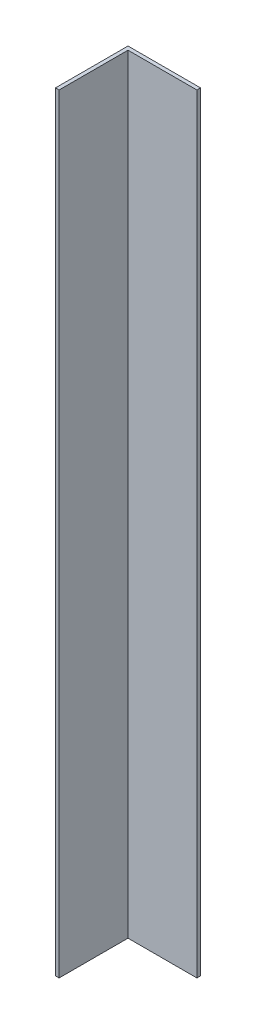
ISO-10303-21;
HEADER;
FILE_DESCRIPTION(('STEP AP214'),'2;1');
FILE_NAME('part.step','',(''),(''),'','','');
FILE_SCHEMA(('AUTOMOTIVE_DESIGN { 1 0 10303 214 1 1 1 1 }'));
ENDSEC;
DATA;
#1=APPLICATION_CONTEXT('core data for automotive mechanical design processes');
#2=APPLICATION_PROTOCOL_DEFINITION('international standard','automotive_design',2000,#1);
#3=PRODUCT_CONTEXT('',#1,'mechanical');
#4=PRODUCT('Part','Part','',(#3));
#5=PRODUCT_RELATED_PRODUCT_CATEGORY('part','',(#4));
#6=PRODUCT_DEFINITION_FORMATION('','',#4);
#7=PRODUCT_DEFINITION_CONTEXT('part definition',#1,'design');
#8=PRODUCT_DEFINITION('design','',#6,#7);
#9=PRODUCT_DEFINITION_SHAPE('','',#8);
#10=(LENGTH_UNIT() NAMED_UNIT(*) SI_UNIT(.MILLI.,.METRE.));
#11=(NAMED_UNIT(*) PLANE_ANGLE_UNIT() SI_UNIT($,.RADIAN.));
#12=(NAMED_UNIT(*) SI_UNIT($,.STERADIAN.) SOLID_ANGLE_UNIT());
#13=UNCERTAINTY_MEASURE_WITH_UNIT(LENGTH_MEASURE(1.E-05),#10,'distance_accuracy_value','');
#14=(GEOMETRIC_REPRESENTATION_CONTEXT(3) GLOBAL_UNCERTAINTY_ASSIGNED_CONTEXT((#13)) GLOBAL_UNIT_ASSIGNED_CONTEXT((#10,
#11,#12)) REPRESENTATION_CONTEXT('',''));
#15=CARTESIAN_POINT('',(0.,0.,0.));
#16=DIRECTION('',(0.,0.,1.));
#17=DIRECTION('',(1.,0.,0.));
#18=AXIS2_PLACEMENT_3D('',#15,#16,#17);
#19=CARTESIAN_POINT('',(-20.,424.,-20.1136363636364));
#20=DIRECTION('',(1.,0.,0.));
#21=DIRECTION('',(0.,0.,-1.));
#22=AXIS2_PLACEMENT_3D('',#19,#20,#21);
#23=PLANE('',#22);
#24=DIRECTION('',(0.,0.,1.));
#25=VECTOR('',#24,1.);
#26=CARTESIAN_POINT('',(-20.,0.,-20.1136363636364));
#27=LINE('',#26,#25);
#28=CARTESIAN_POINT('',(-20.,0.,-20.1136363636364));
#29=VERTEX_POINT('',#28);
#30=CARTESIAN_POINT('',(-20.,0.,19.8863636363636));
#31=VERTEX_POINT('',#30);
#32=EDGE_CURVE('E117',#29,#31,#27,.T.);
#33=ORIENTED_EDGE('',*,*,#32,.T.);
#34=DIRECTION('',(0.,-1.,0.));
#35=VECTOR('',#34,1.);
#36=CARTESIAN_POINT('',(-20.,424.,19.8863636363636));
#37=LINE('',#36,#35);
#38=CARTESIAN_POINT('',(-20.,424.,19.8863636363636));
#39=VERTEX_POINT('',#38);
#40=EDGE_CURVE('E11',#39,#31,#37,.T.);
#41=ORIENTED_EDGE('',*,*,#40,.F.);
#42=DIRECTION('',(0.,0.,1.));
#43=VECTOR('',#42,1.);
#44=CARTESIAN_POINT('',(-20.,424.,-20.1136363636364));
#45=LINE('',#44,#43);
#46=CARTESIAN_POINT('',(-20.,424.,-20.1136363636364));
#47=VERTEX_POINT('',#46);
#48=EDGE_CURVE('E127',#47,#39,#45,.T.);
#49=ORIENTED_EDGE('',*,*,#48,.F.);
#50=DIRECTION('',(0.,-1.,0.));
#51=VECTOR('',#50,1.);
#52=CARTESIAN_POINT('',(-20.,424.,-20.1136363636364));
#53=LINE('',#52,#51);
#54=EDGE_CURVE('E113',#47,#29,#53,.T.);
#55=ORIENTED_EDGE('',*,*,#54,.T.);
#56=EDGE_LOOP('',(#33,#41,#49,#55));
#57=FACE_BOUND('',#56,.T.);
#58=ADVANCED_FACE('F33',(#57),#23,.F.);
#59=CARTESIAN_POINT('',(-20.,424.,19.8863636363636));
#60=DIRECTION('',(0.,0.,-1.));
#61=DIRECTION('',(-1.,0.,0.));
#62=AXIS2_PLACEMENT_3D('',#59,#60,#61);
#63=PLANE('',#62);
#64=DIRECTION('',(1.,0.,0.));
#65=VECTOR('',#64,1.);
#66=CARTESIAN_POINT('',(-20.,0.,19.8863636363636));
#67=LINE('',#66,#65);
#68=CARTESIAN_POINT('',(-18.,0.,19.8863636363636));
#69=VERTEX_POINT('',#68);
#70=EDGE_CURVE('E120',#31,#69,#67,.T.);
#71=ORIENTED_EDGE('',*,*,#70,.T.);
#72=DIRECTION('',(0.,-1.,0.));
#73=VECTOR('',#72,1.);
#74=CARTESIAN_POINT('',(-18.,424.,19.8863636363636));
#75=LINE('',#74,#73);
#76=CARTESIAN_POINT('',(-18.,424.,19.8863636363636));
#77=VERTEX_POINT('',#76);
#78=EDGE_CURVE('E41',#77,#69,#75,.T.);
#79=ORIENTED_EDGE('',*,*,#78,.F.);
#80=DIRECTION('',(1.,0.,0.));
#81=VECTOR('',#80,1.);
#82=CARTESIAN_POINT('',(-20.,424.,19.8863636363636));
#83=LINE('',#82,#81);
#84=EDGE_CURVE('E86',#39,#77,#83,.T.);
#85=ORIENTED_EDGE('',*,*,#84,.F.);
#86=ORIENTED_EDGE('',*,*,#40,.T.);
#87=EDGE_LOOP('',(#71,#79,#85,#86));
#88=FACE_BOUND('',#87,.T.);
#89=ADVANCED_FACE('F151',(#88),#63,.F.);
#90=CARTESIAN_POINT('',(-18.,424.,-18.1136363636364));
#91=DIRECTION('',(-1.,0.,0.));
#92=DIRECTION('',(0.,0.,1.));
#93=AXIS2_PLACEMENT_3D('',#90,#91,#92);
#94=PLANE('',#93);
#95=DIRECTION('',(0.,0.,-1.));
#96=VECTOR('',#95,1.);
#97=CARTESIAN_POINT('',(-18.,0.,-18.1136363636364));
#98=LINE('',#97,#96);
#99=CARTESIAN_POINT('',(-18.,0.,-18.1136363636364));
#100=VERTEX_POINT('',#99);
#101=EDGE_CURVE('E122',#69,#100,#98,.T.);
#102=ORIENTED_EDGE('',*,*,#101,.T.);
#103=DIRECTION('',(0.,-1.,0.));
#104=VECTOR('',#103,1.);
#105=CARTESIAN_POINT('',(-18.,424.,-18.1136363636364));
#106=LINE('',#105,#104);
#107=CARTESIAN_POINT('',(-18.,424.,-18.1136363636364));
#108=VERTEX_POINT('',#107);
#109=EDGE_CURVE('E108',#108,#100,#106,.T.);
#110=ORIENTED_EDGE('',*,*,#109,.F.);
#111=DIRECTION('',(0.,0.,-1.));
#112=VECTOR('',#111,1.);
#113=CARTESIAN_POINT('',(-18.,424.,-18.1136363636364));
#114=LINE('',#113,#112);
#115=EDGE_CURVE('E99',#77,#108,#114,.T.);
#116=ORIENTED_EDGE('',*,*,#115,.F.);
#117=ORIENTED_EDGE('',*,*,#78,.T.);
#118=EDGE_LOOP('',(#102,#110,#116,#117));
#119=FACE_BOUND('',#118,.T.);
#120=ADVANCED_FACE('F133',(#119),#94,.F.);
#121=CARTESIAN_POINT('',(-18.,424.,-18.1136363636364));
#122=DIRECTION('',(0.,0.,-1.));
#123=DIRECTION('',(-1.,0.,0.));
#124=AXIS2_PLACEMENT_3D('',#121,#122,#123);
#125=PLANE('',#124);
#126=DIRECTION('',(1.,0.,0.));
#127=VECTOR('',#126,1.);
#128=CARTESIAN_POINT('',(-18.,0.,-18.1136363636364));
#129=LINE('',#128,#127);
#130=CARTESIAN_POINT('',(20.,0.,-18.1136363636364));
#131=VERTEX_POINT('',#130);
#132=EDGE_CURVE('E107',#100,#131,#129,.T.);
#133=ORIENTED_EDGE('',*,*,#132,.T.);
#134=DIRECTION('',(0.,-1.,0.));
#135=VECTOR('',#134,1.);
#136=CARTESIAN_POINT('',(20.,424.,-18.1136363636364));
#137=LINE('',#136,#135);
#138=CARTESIAN_POINT('',(20.,424.,-18.1136363636364));
#139=VERTEX_POINT('',#138);
#140=EDGE_CURVE('E104',#139,#131,#137,.T.);
#141=ORIENTED_EDGE('',*,*,#140,.F.);
#142=DIRECTION('',(1.,0.,0.));
#143=VECTOR('',#142,1.);
#144=CARTESIAN_POINT('',(-18.,424.,-18.1136363636364));
#145=LINE('',#144,#143);
#146=EDGE_CURVE('E93',#108,#139,#145,.T.);
#147=ORIENTED_EDGE('',*,*,#146,.F.);
#148=ORIENTED_EDGE('',*,*,#109,.T.);
#149=EDGE_LOOP('',(#133,#141,#147,#148));
#150=FACE_BOUND('',#149,.T.);
#151=ADVANCED_FACE('F105',(#150),#125,.F.);
#152=CARTESIAN_POINT('',(20.,424.,-20.1136363636364));
#153=DIRECTION('',(-1.,0.,0.));
#154=DIRECTION('',(0.,0.,1.));
#155=AXIS2_PLACEMENT_3D('',#152,#153,#154);
#156=PLANE('',#155);
#157=DIRECTION('',(0.,0.,-1.));
#158=VECTOR('',#157,1.);
#159=CARTESIAN_POINT('',(20.,0.,-20.1136363636364));
#160=LINE('',#159,#158);
#161=CARTESIAN_POINT('',(20.,0.,-20.1136363636364));
#162=VERTEX_POINT('',#161);
#163=EDGE_CURVE('E72',#131,#162,#160,.T.);
#164=ORIENTED_EDGE('',*,*,#163,.T.);
#165=DIRECTION('',(0.,-1.,0.));
#166=VECTOR('',#165,1.);
#167=CARTESIAN_POINT('',(20.,424.,-20.1136363636364));
#168=LINE('',#167,#166);
#169=CARTESIAN_POINT('',(20.,424.,-20.1136363636364));
#170=VERTEX_POINT('',#169);
#171=EDGE_CURVE('E109',#170,#162,#168,.T.);
#172=ORIENTED_EDGE('',*,*,#171,.F.);
#173=DIRECTION('',(0.,0.,-1.));
#174=VECTOR('',#173,1.);
#175=CARTESIAN_POINT('',(20.,424.,-20.1136363636364));
#176=LINE('',#175,#174);
#177=EDGE_CURVE('E97',#139,#170,#176,.T.);
#178=ORIENTED_EDGE('',*,*,#177,.F.);
#179=ORIENTED_EDGE('',*,*,#140,.T.);
#180=EDGE_LOOP('',(#164,#172,#178,#179));
#181=FACE_BOUND('',#180,.T.);
#182=ADVANCED_FACE('F111',(#181),#156,.F.);
#183=CARTESIAN_POINT('',(-20.,424.,-20.1136363636364));
#184=DIRECTION('',(0.,0.,1.));
#185=DIRECTION('',(1.,0.,0.));
#186=AXIS2_PLACEMENT_3D('',#183,#184,#185);
#187=PLANE('',#186);
#188=DIRECTION('',(-1.,0.,0.));
#189=VECTOR('',#188,1.);
#190=CARTESIAN_POINT('',(-20.,0.,-20.1136363636364));
#191=LINE('',#190,#189);
#192=EDGE_CURVE('E78',#162,#29,#191,.T.);
#193=ORIENTED_EDGE('',*,*,#192,.T.);
#194=ORIENTED_EDGE('',*,*,#54,.F.);
#195=DIRECTION('',(-1.,0.,0.));
#196=VECTOR('',#195,1.);
#197=CARTESIAN_POINT('',(-20.,424.,-20.1136363636364));
#198=LINE('',#197,#196);
#199=EDGE_CURVE('E49',#170,#47,#198,.T.);
#200=ORIENTED_EDGE('',*,*,#199,.F.);
#201=ORIENTED_EDGE('',*,*,#171,.T.);
#202=EDGE_LOOP('',(#193,#194,#200,#201));
#203=FACE_BOUND('',#202,.T.);
#204=ADVANCED_FACE('F140',(#203),#187,.F.);
#205=CARTESIAN_POINT('',(0.,424.,0.));
#206=DIRECTION('',(0.,1.,0.));
#207=DIRECTION('',(0.,0.,1.));
#208=AXIS2_PLACEMENT_3D('',#205,#206,#207);
#209=PLANE('',#208);
#210=ORIENTED_EDGE('',*,*,#48,.T.);
#211=ORIENTED_EDGE('',*,*,#84,.T.);
#212=ORIENTED_EDGE('',*,*,#115,.T.);
#213=ORIENTED_EDGE('',*,*,#146,.T.);
#214=ORIENTED_EDGE('',*,*,#177,.T.);
#215=ORIENTED_EDGE('',*,*,#199,.T.);
#216=EDGE_LOOP('',(#210,#211,#212,#213,#214,#215));
#217=FACE_BOUND('',#216,.T.);
#218=ADVANCED_FACE('F95',(#217),#209,.T.);
#219=CARTESIAN_POINT('',(0.,0.,0.));
#220=DIRECTION('',(0.,1.,0.));
#221=DIRECTION('',(0.,0.,1.));
#222=AXIS2_PLACEMENT_3D('',#219,#220,#221);
#223=PLANE('',#222);
#224=ORIENTED_EDGE('',*,*,#32,.F.);
#225=ORIENTED_EDGE('',*,*,#192,.F.);
#226=ORIENTED_EDGE('',*,*,#163,.F.);
#227=ORIENTED_EDGE('',*,*,#132,.F.);
#228=ORIENTED_EDGE('',*,*,#101,.F.);
#229=ORIENTED_EDGE('',*,*,#70,.F.);
#230=EDGE_LOOP('',(#224,#225,#226,#227,#228,#229));
#231=FACE_BOUND('',#230,.T.);
#232=ADVANCED_FACE('F136',(#231),#223,.F.);
#233=CLOSED_SHELL('',(#58,#89,#120,#151,#182,#204,#218,#232));
#234=MANIFOLD_SOLID_BREP('B2',#233);
#235=ADVANCED_BREP_SHAPE_REPRESENTATION('',(#18,#234),#14);
#236=SHAPE_DEFINITION_REPRESENTATION(#9,#235);
ENDSEC;
END-ISO-10303-21;
